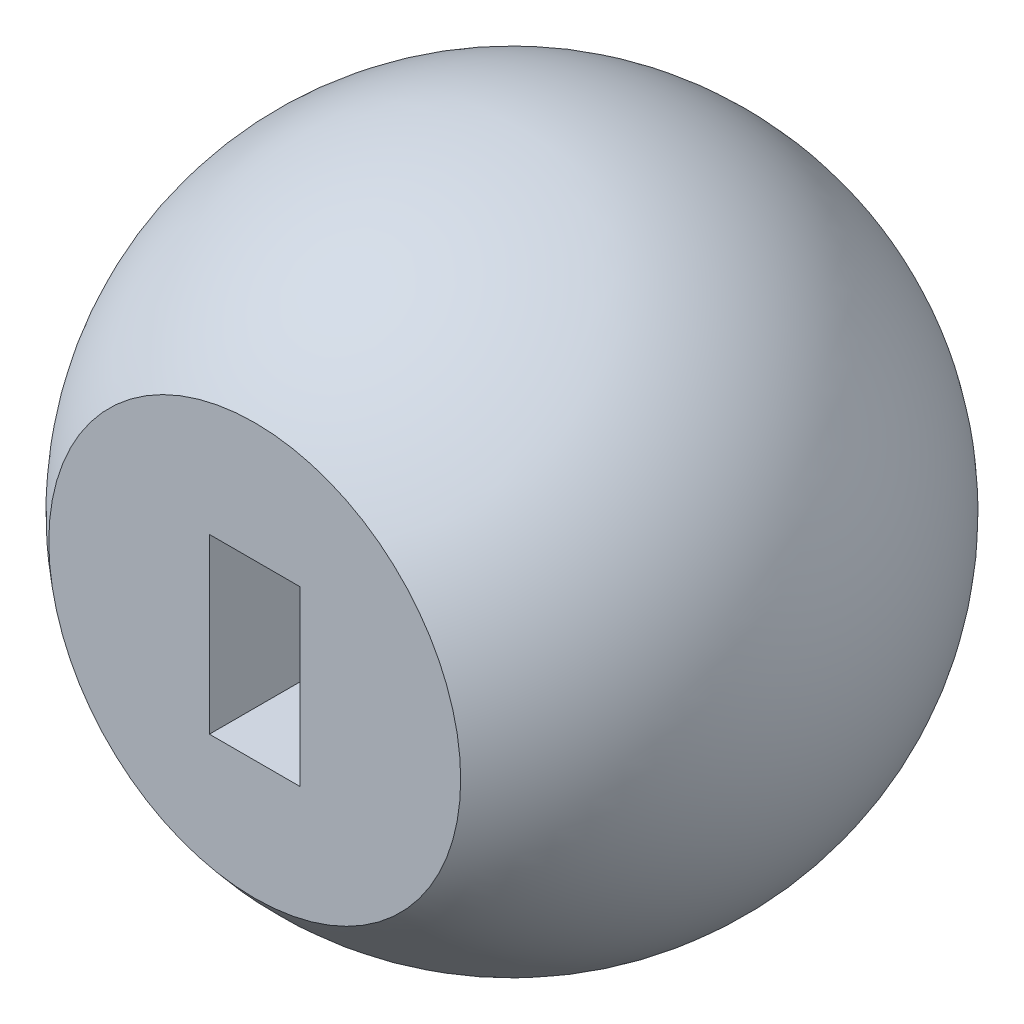
ISO-10303-21;
HEADER;
FILE_DESCRIPTION(('STEP AP214'),'2;1');
FILE_NAME('part.step','',(''),(''),'','','');
FILE_SCHEMA(('AUTOMOTIVE_DESIGN { 1 0 10303 214 1 1 1 1 }'));
ENDSEC;
DATA;
#1=APPLICATION_CONTEXT('core data for automotive mechanical design processes');
#2=APPLICATION_PROTOCOL_DEFINITION('international standard','automotive_design',2000,#1);
#3=PRODUCT_CONTEXT('',#1,'mechanical');
#4=PRODUCT('Part','Part','',(#3));
#5=PRODUCT_RELATED_PRODUCT_CATEGORY('part','',(#4));
#6=PRODUCT_DEFINITION_FORMATION('','',#4);
#7=PRODUCT_DEFINITION_CONTEXT('part definition',#1,'design');
#8=PRODUCT_DEFINITION('design','',#6,#7);
#9=PRODUCT_DEFINITION_SHAPE('','',#8);
#10=(LENGTH_UNIT() NAMED_UNIT(*) SI_UNIT(.MILLI.,.METRE.));
#11=(NAMED_UNIT(*) PLANE_ANGLE_UNIT() SI_UNIT($,.RADIAN.));
#12=(NAMED_UNIT(*) SI_UNIT($,.STERADIAN.) SOLID_ANGLE_UNIT());
#13=UNCERTAINTY_MEASURE_WITH_UNIT(LENGTH_MEASURE(1.E-05),#10,'distance_accuracy_value','');
#14=(GEOMETRIC_REPRESENTATION_CONTEXT(3) GLOBAL_UNCERTAINTY_ASSIGNED_CONTEXT((#13)) GLOBAL_UNIT_ASSIGNED_CONTEXT((#10,
#11,#12)) REPRESENTATION_CONTEXT('',''));
#15=CARTESIAN_POINT('',(0.,0.,0.));
#16=DIRECTION('',(0.,0.,1.));
#17=DIRECTION('',(1.,0.,0.));
#18=AXIS2_PLACEMENT_3D('',#15,#16,#17);
#19=CARTESIAN_POINT('',(0.,0.,0.));
#20=DIRECTION('',(0.,0.,1.));
#21=DIRECTION('',(-1.,0.,0.));
#22=AXIS2_PLACEMENT_3D('',#19,#20,#21);
#23=SPHERICAL_SURFACE('',#22,8.);
#24=CARTESIAN_POINT('',(0.,0.,6.2449979983984));
#25=DIRECTION('',(0.,0.,1.));
#26=DIRECTION('',(1.,0.,0.));
#27=AXIS2_PLACEMENT_3D('',#24,#25,#26);
#28=CIRCLE('',#27,5.);
#29=CARTESIAN_POINT('',(5.,0.,6.2449979983984));
#30=VERTEX_POINT('',#29);
#31=EDGE_CURVE('E11',#30,#30,#28,.T.);
#32=ORIENTED_EDGE('',*,*,#31,.F.);
#33=EDGE_LOOP('',(#32));
#34=FACE_BOUND('',#33,.T.);
#35=ADVANCED_FACE('F39',(#34),#23,.T.);
#36=CARTESIAN_POINT('',(-5.,0.,6.2449979983984));
#37=DIRECTION('',(0.,0.,-1.));
#38=DIRECTION('',(-1.,0.,0.));
#39=AXIS2_PLACEMENT_3D('',#36,#37,#38);
#40=PLANE('',#39);
#41=DIRECTION('',(-1.,0.,0.));
#42=VECTOR('',#41,1.);
#43=CARTESIAN_POINT('',(-1.1,2.1,6.2449979983984));
#44=LINE('',#43,#42);
#45=CARTESIAN_POINT('',(1.1,2.1,6.2449979983984));
#46=VERTEX_POINT('',#45);
#47=CARTESIAN_POINT('',(-1.1,2.1,6.2449979983984));
#48=VERTEX_POINT('',#47);
#49=EDGE_CURVE('E87',#46,#48,#44,.T.);
#50=ORIENTED_EDGE('',*,*,#49,.F.);
#51=DIRECTION('',(0.,1.,0.));
#52=VECTOR('',#51,1.);
#53=CARTESIAN_POINT('',(1.1,2.1,6.2449979983984));
#54=LINE('',#53,#52);
#55=CARTESIAN_POINT('',(1.1,-2.1,6.2449979983984));
#56=VERTEX_POINT('',#55);
#57=EDGE_CURVE('E53',#56,#46,#54,.T.);
#58=ORIENTED_EDGE('',*,*,#57,.F.);
#59=DIRECTION('',(1.,0.,0.));
#60=VECTOR('',#59,1.);
#61=CARTESIAN_POINT('',(-1.1,-2.1,6.2449979983984));
#62=LINE('',#61,#60);
#63=CARTESIAN_POINT('',(-1.1,-2.1,6.2449979983984));
#64=VERTEX_POINT('',#63);
#65=EDGE_CURVE('E103',#64,#56,#62,.T.);
#66=ORIENTED_EDGE('',*,*,#65,.F.);
#67=DIRECTION('',(0.,-1.,0.));
#68=VECTOR('',#67,1.);
#69=CARTESIAN_POINT('',(-1.1,2.1,6.2449979983984));
#70=LINE('',#69,#68);
#71=EDGE_CURVE('E109',#48,#64,#70,.T.);
#72=ORIENTED_EDGE('',*,*,#71,.F.);
#73=EDGE_LOOP('',(#50,#58,#66,#72));
#74=FACE_BOUND('',#73,.T.);
#75=ORIENTED_EDGE('',*,*,#31,.T.);
#76=EDGE_LOOP('',(#75));
#77=FACE_BOUND('',#76,.T.);
#78=ADVANCED_FACE('F114',(#74,#77),#40,.F.);
#79=CARTESIAN_POINT('',(1.1,2.1,2.0449979983984));
#80=DIRECTION('',(1.,0.,0.));
#81=DIRECTION('',(0.,1.,0.));
#82=AXIS2_PLACEMENT_3D('',#79,#80,#81);
#83=PLANE('',#82);
#84=ORIENTED_EDGE('',*,*,#57,.T.);
#85=DIRECTION('',(0.,0.,1.));
#86=VECTOR('',#85,1.);
#87=CARTESIAN_POINT('',(1.1,2.1,2.0449979983984));
#88=LINE('',#87,#86);
#89=CARTESIAN_POINT('',(1.1,2.1,2.0449979983984));
#90=VERTEX_POINT('',#89);
#91=EDGE_CURVE('E75',#90,#46,#88,.T.);
#92=ORIENTED_EDGE('',*,*,#91,.F.);
#93=DIRECTION('',(0.,1.,0.));
#94=VECTOR('',#93,1.);
#95=CARTESIAN_POINT('',(1.1,2.1,2.0449979983984));
#96=LINE('',#95,#94);
#97=CARTESIAN_POINT('',(1.1,-2.1,2.0449979983984));
#98=VERTEX_POINT('',#97);
#99=EDGE_CURVE('E101',#98,#90,#96,.T.);
#100=ORIENTED_EDGE('',*,*,#99,.F.);
#101=DIRECTION('',(0.,0.,1.));
#102=VECTOR('',#101,1.);
#103=CARTESIAN_POINT('',(1.1,-2.1,2.0449979983984));
#104=LINE('',#103,#102);
#105=EDGE_CURVE('E46',#98,#56,#104,.T.);
#106=ORIENTED_EDGE('',*,*,#105,.T.);
#107=EDGE_LOOP('',(#84,#92,#100,#106));
#108=FACE_BOUND('',#107,.T.);
#109=ADVANCED_FACE('F119',(#108),#83,.F.);
#110=CARTESIAN_POINT('',(-1.1,-2.1,2.0449979983984));
#111=DIRECTION('',(0.,-1.,0.));
#112=DIRECTION('',(0.,0.,-1.));
#113=AXIS2_PLACEMENT_3D('',#110,#111,#112);
#114=PLANE('',#113);
#115=ORIENTED_EDGE('',*,*,#65,.T.);
#116=ORIENTED_EDGE('',*,*,#105,.F.);
#117=DIRECTION('',(1.,0.,0.));
#118=VECTOR('',#117,1.);
#119=CARTESIAN_POINT('',(-1.1,-2.1,2.0449979983984));
#120=LINE('',#119,#118);
#121=CARTESIAN_POINT('',(-1.1,-2.1,2.0449979983984));
#122=VERTEX_POINT('',#121);
#123=EDGE_CURVE('E98',#122,#98,#120,.T.);
#124=ORIENTED_EDGE('',*,*,#123,.F.);
#125=DIRECTION('',(0.,0.,1.));
#126=VECTOR('',#125,1.);
#127=CARTESIAN_POINT('',(-1.1,-2.1,2.0449979983984));
#128=LINE('',#127,#126);
#129=EDGE_CURVE('E91',#122,#64,#128,.T.);
#130=ORIENTED_EDGE('',*,*,#129,.T.);
#131=EDGE_LOOP('',(#115,#116,#124,#130));
#132=FACE_BOUND('',#131,.T.);
#133=ADVANCED_FACE('F117',(#132),#114,.F.);
#134=CARTESIAN_POINT('',(-1.1,2.1,2.0449979983984));
#135=DIRECTION('',(-1.,0.,0.));
#136=DIRECTION('',(0.,-1.,0.));
#137=AXIS2_PLACEMENT_3D('',#134,#135,#136);
#138=PLANE('',#137);
#139=ORIENTED_EDGE('',*,*,#71,.T.);
#140=ORIENTED_EDGE('',*,*,#129,.F.);
#141=DIRECTION('',(0.,-1.,0.));
#142=VECTOR('',#141,1.);
#143=CARTESIAN_POINT('',(-1.1,2.1,2.0449979983984));
#144=LINE('',#143,#142);
#145=CARTESIAN_POINT('',(-1.1,2.1,2.0449979983984));
#146=VERTEX_POINT('',#145);
#147=EDGE_CURVE('E94',#146,#122,#144,.T.);
#148=ORIENTED_EDGE('',*,*,#147,.F.);
#149=DIRECTION('',(0.,0.,1.));
#150=VECTOR('',#149,1.);
#151=CARTESIAN_POINT('',(-1.1,2.1,2.0449979983984));
#152=LINE('',#151,#150);
#153=EDGE_CURVE('E80',#146,#48,#152,.T.);
#154=ORIENTED_EDGE('',*,*,#153,.T.);
#155=EDGE_LOOP('',(#139,#140,#148,#154));
#156=FACE_BOUND('',#155,.T.);
#157=ADVANCED_FACE('F95',(#156),#138,.F.);
#158=CARTESIAN_POINT('',(-1.1,2.1,2.0449979983984));
#159=DIRECTION('',(0.,1.,0.));
#160=DIRECTION('',(0.,0.,1.));
#161=AXIS2_PLACEMENT_3D('',#158,#159,#160);
#162=PLANE('',#161);
#163=ORIENTED_EDGE('',*,*,#49,.T.);
#164=ORIENTED_EDGE('',*,*,#153,.F.);
#165=DIRECTION('',(-1.,0.,0.));
#166=VECTOR('',#165,1.);
#167=CARTESIAN_POINT('',(-1.1,2.1,2.0449979983984));
#168=LINE('',#167,#166);
#169=EDGE_CURVE('E84',#90,#146,#168,.T.);
#170=ORIENTED_EDGE('',*,*,#169,.F.);
#171=ORIENTED_EDGE('',*,*,#91,.T.);
#172=EDGE_LOOP('',(#163,#164,#170,#171));
#173=FACE_BOUND('',#172,.T.);
#174=ADVANCED_FACE('F82',(#173),#162,.F.);
#175=CARTESIAN_POINT('',(0.,0.,2.0449979983984));
#176=DIRECTION('',(0.,0.,1.));
#177=DIRECTION('',(1.,0.,0.));
#178=AXIS2_PLACEMENT_3D('',#175,#176,#177);
#179=PLANE('',#178);
#180=ORIENTED_EDGE('',*,*,#99,.T.);
#181=ORIENTED_EDGE('',*,*,#169,.T.);
#182=ORIENTED_EDGE('',*,*,#147,.T.);
#183=ORIENTED_EDGE('',*,*,#123,.T.);
#184=EDGE_LOOP('',(#180,#181,#182,#183));
#185=FACE_BOUND('',#184,.T.);
#186=ADVANCED_FACE('F100',(#185),#179,.T.);
#187=CLOSED_SHELL('',(#35,#78,#109,#133,#157,#174,#186));
#188=MANIFOLD_SOLID_BREP('B2',#187);
#189=ADVANCED_BREP_SHAPE_REPRESENTATION('',(#18,#188),#14);
#190=SHAPE_DEFINITION_REPRESENTATION(#9,#189);
ENDSEC;
END-ISO-10303-21;
